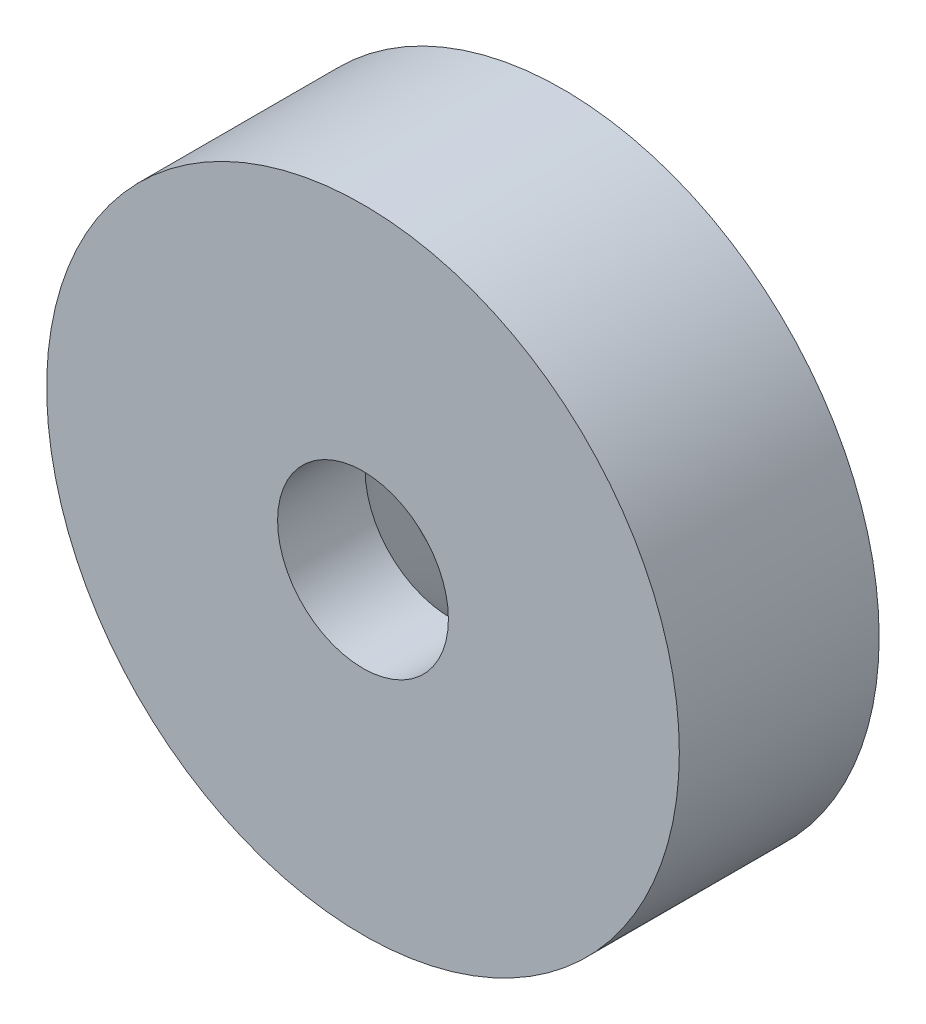
ISO-10303-21;
HEADER;
FILE_DESCRIPTION(('STEP AP214'),'2;1');
FILE_NAME('part.step','',(''),(''),'','','');
FILE_SCHEMA(('AUTOMOTIVE_DESIGN { 1 0 10303 214 1 1 1 1 }'));
ENDSEC;
DATA;
#1=APPLICATION_CONTEXT('core data for automotive mechanical design processes');
#2=APPLICATION_PROTOCOL_DEFINITION('international standard','automotive_design',2000,#1);
#3=PRODUCT_CONTEXT('',#1,'mechanical');
#4=PRODUCT('Part','Part','',(#3));
#5=PRODUCT_RELATED_PRODUCT_CATEGORY('part','',(#4));
#6=PRODUCT_DEFINITION_FORMATION('','',#4);
#7=PRODUCT_DEFINITION_CONTEXT('part definition',#1,'design');
#8=PRODUCT_DEFINITION('design','',#6,#7);
#9=PRODUCT_DEFINITION_SHAPE('','',#8);
#10=(LENGTH_UNIT() NAMED_UNIT(*) SI_UNIT(.MILLI.,.METRE.));
#11=(NAMED_UNIT(*) PLANE_ANGLE_UNIT() SI_UNIT($,.RADIAN.));
#12=(NAMED_UNIT(*) SI_UNIT($,.STERADIAN.) SOLID_ANGLE_UNIT());
#13=UNCERTAINTY_MEASURE_WITH_UNIT(LENGTH_MEASURE(1.E-05),#10,'distance_accuracy_value','');
#14=(GEOMETRIC_REPRESENTATION_CONTEXT(3) GLOBAL_UNCERTAINTY_ASSIGNED_CONTEXT((#13)) GLOBAL_UNIT_ASSIGNED_CONTEXT((#10,
#11,#12)) REPRESENTATION_CONTEXT('',''));
#15=CARTESIAN_POINT('',(0.,0.,0.));
#16=DIRECTION('',(0.,0.,1.));
#17=DIRECTION('',(1.,0.,0.));
#18=AXIS2_PLACEMENT_3D('',#15,#16,#17);
#19=CARTESIAN_POINT('',(5.05628521189009,23.0789914296533,3.79));
#20=DIRECTION('',(0.,0.,1.));
#21=DIRECTION('',(1.,0.,0.));
#22=AXIS2_PLACEMENT_3D('',#19,#20,#21);
#23=PLANE('',#22);
#24=CARTESIAN_POINT('',(5.05628521189009,23.0789914296533,3.79));
#25=DIRECTION('',(0.,0.,1.));
#26=DIRECTION('',(1.,0.,0.));
#27=AXIS2_PLACEMENT_3D('',#24,#25,#26);
#28=CIRCLE('',#27,6.);
#29=CARTESIAN_POINT('',(11.0562852118901,23.0789914296533,3.79));
#30=VERTEX_POINT('',#29);
#31=EDGE_CURVE('E10',#30,#30,#28,.T.);
#32=ORIENTED_EDGE('',*,*,#31,.T.);
#33=EDGE_LOOP('',(#32));
#34=FACE_BOUND('',#33,.T.);
#35=CARTESIAN_POINT('',(5.05628521189009,23.0789914296533,3.79));
#36=DIRECTION('',(0.,0.,1.));
#37=DIRECTION('',(1.,0.,0.));
#38=AXIS2_PLACEMENT_3D('',#35,#36,#37);
#39=CIRCLE('',#38,1.62);
#40=CARTESIAN_POINT('',(6.67628521189009,23.0789914296533,3.79));
#41=VERTEX_POINT('',#40);
#42=EDGE_CURVE('E43',#41,#41,#39,.T.);
#43=ORIENTED_EDGE('',*,*,#42,.F.);
#44=EDGE_LOOP('',(#43));
#45=FACE_BOUND('',#44,.T.);
#46=ADVANCED_FACE('F30',(#34,#45),#23,.T.);
#47=CARTESIAN_POINT('',(5.05628521189009,23.0789914296533,0.));
#48=DIRECTION('',(0.,0.,1.));
#49=DIRECTION('',(1.,0.,0.));
#50=AXIS2_PLACEMENT_3D('',#47,#48,#49);
#51=PLANE('',#50);
#52=CARTESIAN_POINT('',(5.05628521189009,23.0789914296533,0.));
#53=DIRECTION('',(0.,0.,-1.));
#54=DIRECTION('',(-1.,0.,0.));
#55=AXIS2_PLACEMENT_3D('',#52,#53,#54);
#56=CIRCLE('',#55,3.75);
#57=CARTESIAN_POINT('',(1.30628521189009,23.0789914296533,0.));
#58=VERTEX_POINT('',#57);
#59=EDGE_CURVE('E47',#58,#58,#56,.T.);
#60=ORIENTED_EDGE('',*,*,#59,.F.);
#61=EDGE_LOOP('',(#60));
#62=FACE_BOUND('',#61,.T.);
#63=CARTESIAN_POINT('',(5.05628521189009,23.0789914296533,0.));
#64=DIRECTION('',(0.,0.,1.));
#65=DIRECTION('',(1.,0.,0.));
#66=AXIS2_PLACEMENT_3D('',#63,#64,#65);
#67=CIRCLE('',#66,6.);
#68=CARTESIAN_POINT('',(11.0562852118901,23.0789914296533,0.));
#69=VERTEX_POINT('',#68);
#70=EDGE_CURVE('E38',#69,#69,#67,.T.);
#71=ORIENTED_EDGE('',*,*,#70,.F.);
#72=EDGE_LOOP('',(#71));
#73=FACE_BOUND('',#72,.T.);
#74=ADVANCED_FACE('F63',(#62,#73),#51,.F.);
#75=CARTESIAN_POINT('',(5.05628521189009,23.0789914296533,3.79));
#76=DIRECTION('',(0.,0.,-1.));
#77=DIRECTION('',(-1.,0.,0.));
#78=AXIS2_PLACEMENT_3D('',#75,#76,#77);
#79=CYLINDRICAL_SURFACE('',#78,6.);
#80=ORIENTED_EDGE('',*,*,#31,.F.);
#81=EDGE_LOOP('',(#80));
#82=FACE_BOUND('',#81,.T.);
#83=ORIENTED_EDGE('',*,*,#70,.T.);
#84=EDGE_LOOP('',(#83));
#85=FACE_BOUND('',#84,.T.);
#86=ADVANCED_FACE('F32',(#82,#85),#79,.T.);
#87=CARTESIAN_POINT('',(5.05628521189009,23.0789914296533,3.79));
#88=DIRECTION('',(0.,0.,-1.));
#89=DIRECTION('',(-1.,0.,0.));
#90=AXIS2_PLACEMENT_3D('',#87,#88,#89);
#91=CYLINDRICAL_SURFACE('',#90,1.62);
#92=CARTESIAN_POINT('',(5.05628521189009,23.0789914296533,2.12999999999999));
#93=DIRECTION('',(0.,0.,-1.));
#94=DIRECTION('',(-1.,0.,0.));
#95=AXIS2_PLACEMENT_3D('',#92,#93,#94);
#96=CIRCLE('',#95,1.62);
#97=CARTESIAN_POINT('',(3.43628521189009,23.0789914296533,2.12999999999999));
#98=VERTEX_POINT('',#97);
#99=EDGE_CURVE('E34',#98,#98,#96,.F.);
#100=ORIENTED_EDGE('',*,*,#99,.F.);
#101=EDGE_LOOP('',(#100));
#102=FACE_BOUND('',#101,.T.);
#103=ORIENTED_EDGE('',*,*,#42,.T.);
#104=EDGE_LOOP('',(#103));
#105=FACE_BOUND('',#104,.T.);
#106=ADVANCED_FACE('F56',(#102,#105),#91,.F.);
#107=CARTESIAN_POINT('',(5.05628521189009,23.0789914296533,0.));
#108=DIRECTION('',(0.,0.,-1.));
#109=DIRECTION('',(-1.,0.,0.));
#110=AXIS2_PLACEMENT_3D('',#107,#108,#109);
#111=CONICAL_SURFACE('',#110,3.75,0.78539816339745);
#112=ORIENTED_EDGE('',*,*,#99,.T.);
#113=EDGE_LOOP('',(#112));
#114=FACE_BOUND('',#113,.T.);
#115=ORIENTED_EDGE('',*,*,#59,.T.);
#116=EDGE_LOOP('',(#115));
#117=FACE_BOUND('',#116,.T.);
#118=ADVANCED_FACE('F54',(#114,#117),#111,.F.);
#119=CLOSED_SHELL('',(#46,#74,#86,#106,#118));
#120=MANIFOLD_SOLID_BREP('B2',#119);
#121=ADVANCED_BREP_SHAPE_REPRESENTATION('',(#18,#120),#14);
#122=SHAPE_DEFINITION_REPRESENTATION(#9,#121);
ENDSEC;
END-ISO-10303-21;
